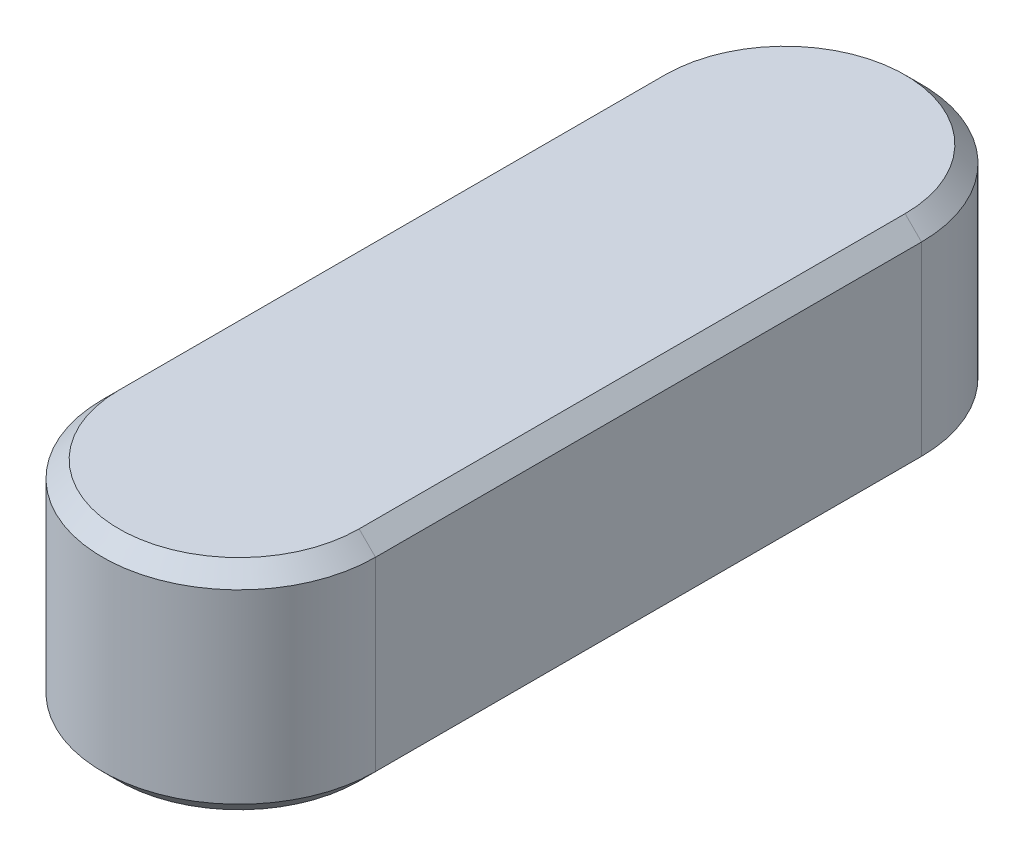
ISO-10303-21;
HEADER;
FILE_DESCRIPTION(('STEP AP214'),'2;1');
FILE_NAME('part.step','',(''),(''),'','','');
FILE_SCHEMA(('AUTOMOTIVE_DESIGN { 1 0 10303 214 1 1 1 1 }'));
ENDSEC;
DATA;
#1=APPLICATION_CONTEXT('core data for automotive mechanical design processes');
#2=APPLICATION_PROTOCOL_DEFINITION('international standard','automotive_design',2000,#1);
#3=PRODUCT_CONTEXT('',#1,'mechanical');
#4=PRODUCT('Part','Part','',(#3));
#5=PRODUCT_RELATED_PRODUCT_CATEGORY('part','',(#4));
#6=PRODUCT_DEFINITION_FORMATION('','',#4);
#7=PRODUCT_DEFINITION_CONTEXT('part definition',#1,'design');
#8=PRODUCT_DEFINITION('design','',#6,#7);
#9=PRODUCT_DEFINITION_SHAPE('','',#8);
#10=(LENGTH_UNIT() NAMED_UNIT(*) SI_UNIT(.MILLI.,.METRE.));
#11=(NAMED_UNIT(*) PLANE_ANGLE_UNIT() SI_UNIT($,.RADIAN.));
#12=(NAMED_UNIT(*) SI_UNIT($,.STERADIAN.) SOLID_ANGLE_UNIT());
#13=UNCERTAINTY_MEASURE_WITH_UNIT(LENGTH_MEASURE(1.E-05),#10,'distance_accuracy_value','');
#14=(GEOMETRIC_REPRESENTATION_CONTEXT(3) GLOBAL_UNCERTAINTY_ASSIGNED_CONTEXT((#13)) GLOBAL_UNIT_ASSIGNED_CONTEXT((#10,
#11,#12)) REPRESENTATION_CONTEXT('',''));
#15=CARTESIAN_POINT('',(0.,0.,0.));
#16=DIRECTION('',(0.,0.,1.));
#17=DIRECTION('',(1.,0.,0.));
#18=AXIS2_PLACEMENT_3D('',#15,#16,#17);
#19=CARTESIAN_POINT('',(0.,8.,0.));
#20=DIRECTION('',(0.,-1.,0.));
#21=DIRECTION('',(0.,0.,-1.));
#22=AXIS2_PLACEMENT_3D('',#19,#20,#21);
#23=CYLINDRICAL_SURFACE('',#22,5.);
#24=DIRECTION('',(0.,-1.,0.));
#25=VECTOR('',#24,1.);
#26=CARTESIAN_POINT('',(5.,8.,0.));
#27=LINE('',#26,#25);
#28=CARTESIAN_POINT('',(5.,7.4,0.));
#29=VERTEX_POINT('',#28);
#30=CARTESIAN_POINT('',(5.,0.6,0.));
#31=VERTEX_POINT('',#30);
#32=EDGE_CURVE('E137',#29,#31,#27,.T.);
#33=ORIENTED_EDGE('',*,*,#32,.F.);
#34=CARTESIAN_POINT('',(0.,7.4,0.));
#35=DIRECTION('',(0.,-1.,0.));
#36=DIRECTION('',(0.,0.,-1.));
#37=AXIS2_PLACEMENT_3D('',#34,#35,#36);
#38=CIRCLE('',#37,5.);
#39=CARTESIAN_POINT('',(-5.,7.4,0.));
#40=VERTEX_POINT('',#39);
#41=EDGE_CURVE('E140',#29,#40,#38,.T.);
#42=ORIENTED_EDGE('',*,*,#41,.T.);
#43=DIRECTION('',(0.,-1.,0.));
#44=VECTOR('',#43,1.);
#45=CARTESIAN_POINT('',(-5.,8.,0.));
#46=LINE('',#45,#44);
#47=CARTESIAN_POINT('',(-5.,0.6,0.));
#48=VERTEX_POINT('',#47);
#49=EDGE_CURVE('E146',#40,#48,#46,.T.);
#50=ORIENTED_EDGE('',*,*,#49,.T.);
#51=CARTESIAN_POINT('',(0.,0.6,0.));
#52=DIRECTION('',(0.,-1.,0.));
#53=DIRECTION('',(0.,0.,-1.));
#54=AXIS2_PLACEMENT_3D('',#51,#52,#53);
#55=CIRCLE('',#54,5.);
#56=EDGE_CURVE('E193',#48,#31,#55,.F.);
#57=ORIENTED_EDGE('',*,*,#56,.T.);
#58=EDGE_LOOP('',(#33,#42,#50,#57));
#59=FACE_BOUND('',#58,.T.);
#60=ADVANCED_FACE('F45',(#59),#23,.T.);
#61=CARTESIAN_POINT('',(5.,8.,0.));
#62=DIRECTION('',(-1.,0.,0.));
#63=DIRECTION('',(0.,0.,1.));
#64=AXIS2_PLACEMENT_3D('',#61,#62,#63);
#65=PLANE('',#64);
#66=DIRECTION('',(0.,-1.,0.));
#67=VECTOR('',#66,1.);
#68=CARTESIAN_POINT('',(5.,8.,-20.));
#69=LINE('',#68,#67);
#70=CARTESIAN_POINT('',(5.,7.4,-20.));
#71=VERTEX_POINT('',#70);
#72=CARTESIAN_POINT('',(5.,0.6,-20.));
#73=VERTEX_POINT('',#72);
#74=EDGE_CURVE('E211',#71,#73,#69,.T.);
#75=ORIENTED_EDGE('',*,*,#74,.F.);
#76=DIRECTION('',(0.,0.,1.));
#77=VECTOR('',#76,1.);
#78=CARTESIAN_POINT('',(5.,7.4,0.));
#79=LINE('',#78,#77);
#80=EDGE_CURVE('E179',#71,#29,#79,.T.);
#81=ORIENTED_EDGE('',*,*,#80,.T.);
#82=ORIENTED_EDGE('',*,*,#32,.T.);
#83=DIRECTION('',(0.,0.,-1.));
#84=VECTOR('',#83,1.);
#85=CARTESIAN_POINT('',(5.,0.6,-20.));
#86=LINE('',#85,#84);
#87=EDGE_CURVE('E182',#31,#73,#86,.T.);
#88=ORIENTED_EDGE('',*,*,#87,.T.);
#89=EDGE_LOOP('',(#75,#81,#82,#88));
#90=FACE_BOUND('',#89,.T.);
#91=ADVANCED_FACE('F236',(#90),#65,.F.);
#92=CARTESIAN_POINT('',(0.,8.,-20.));
#93=DIRECTION('',(0.,-1.,0.));
#94=DIRECTION('',(0.,0.,-1.));
#95=AXIS2_PLACEMENT_3D('',#92,#93,#94);
#96=CYLINDRICAL_SURFACE('',#95,5.);
#97=DIRECTION('',(0.,-1.,0.));
#98=VECTOR('',#97,1.);
#99=CARTESIAN_POINT('',(-5.,8.,-20.));
#100=LINE('',#99,#98);
#101=CARTESIAN_POINT('',(-5.,7.4,-20.));
#102=VERTEX_POINT('',#101);
#103=CARTESIAN_POINT('',(-5.,0.6,-20.));
#104=VERTEX_POINT('',#103);
#105=EDGE_CURVE('E215',#102,#104,#100,.T.);
#106=ORIENTED_EDGE('',*,*,#105,.F.);
#107=CARTESIAN_POINT('',(0.,7.4,-20.));
#108=DIRECTION('',(0.,-1.,0.));
#109=DIRECTION('',(0.,0.,-1.));
#110=AXIS2_PLACEMENT_3D('',#107,#108,#109);
#111=CIRCLE('',#110,5.);
#112=EDGE_CURVE('E185',#102,#71,#111,.T.);
#113=ORIENTED_EDGE('',*,*,#112,.T.);
#114=ORIENTED_EDGE('',*,*,#74,.T.);
#115=CARTESIAN_POINT('',(0.,0.6,-20.));
#116=DIRECTION('',(0.,-1.,0.));
#117=DIRECTION('',(0.,0.,-1.));
#118=AXIS2_PLACEMENT_3D('',#115,#116,#117);
#119=CIRCLE('',#118,5.);
#120=EDGE_CURVE('E188',#73,#104,#119,.F.);
#121=ORIENTED_EDGE('',*,*,#120,.T.);
#122=EDGE_LOOP('',(#106,#113,#114,#121));
#123=FACE_BOUND('',#122,.T.);
#124=ADVANCED_FACE('F234',(#123),#96,.T.);
#125=CARTESIAN_POINT('',(-5.,8.,0.));
#126=DIRECTION('',(1.,0.,0.));
#127=DIRECTION('',(0.,0.,-1.));
#128=AXIS2_PLACEMENT_3D('',#125,#126,#127);
#129=PLANE('',#128);
#130=ORIENTED_EDGE('',*,*,#49,.F.);
#131=DIRECTION('',(0.,0.,-1.));
#132=VECTOR('',#131,1.);
#133=CARTESIAN_POINT('',(-5.,7.4,0.));
#134=LINE('',#133,#132);
#135=EDGE_CURVE('E196',#40,#102,#134,.T.);
#136=ORIENTED_EDGE('',*,*,#135,.T.);
#137=ORIENTED_EDGE('',*,*,#105,.T.);
#138=DIRECTION('',(0.,0.,1.));
#139=VECTOR('',#138,1.);
#140=CARTESIAN_POINT('',(-5.,0.6,0.));
#141=LINE('',#140,#139);
#142=EDGE_CURVE('E200',#104,#48,#141,.T.);
#143=ORIENTED_EDGE('',*,*,#142,.T.);
#144=EDGE_LOOP('',(#130,#136,#137,#143));
#145=FACE_BOUND('',#144,.T.);
#146=ADVANCED_FACE('F225',(#145),#129,.F.);
#147=CARTESIAN_POINT('',(0.,8.,0.));
#148=DIRECTION('',(0.,-1.,0.));
#149=DIRECTION('',(0.,0.,-1.));
#150=AXIS2_PLACEMENT_3D('',#147,#148,#149);
#151=PLANE('',#150);
#152=CARTESIAN_POINT('',(0.,8.,-20.));
#153=DIRECTION('',(0.,-1.,0.));
#154=DIRECTION('',(0.,0.,-1.));
#155=AXIS2_PLACEMENT_3D('',#152,#153,#154);
#156=CIRCLE('',#155,4.4);
#157=CARTESIAN_POINT('',(4.4,8.,-20.));
#158=VERTEX_POINT('',#157);
#159=CARTESIAN_POINT('',(-4.4,8.,-20.));
#160=VERTEX_POINT('',#159);
#161=EDGE_CURVE('E125',#158,#160,#156,.F.);
#162=ORIENTED_EDGE('',*,*,#161,.T.);
#163=DIRECTION('',(0.,0.,1.));
#164=VECTOR('',#163,1.);
#165=CARTESIAN_POINT('',(-4.4,8.,0.));
#166=LINE('',#165,#164);
#167=CARTESIAN_POINT('',(-4.4,8.,0.));
#168=VERTEX_POINT('',#167);
#169=EDGE_CURVE('E120',#160,#168,#166,.T.);
#170=ORIENTED_EDGE('',*,*,#169,.T.);
#171=CARTESIAN_POINT('',(0.,8.,0.));
#172=DIRECTION('',(0.,-1.,0.));
#173=DIRECTION('',(0.,0.,-1.));
#174=AXIS2_PLACEMENT_3D('',#171,#172,#173);
#175=CIRCLE('',#174,4.4);
#176=CARTESIAN_POINT('',(4.4,8.,0.));
#177=VERTEX_POINT('',#176);
#178=EDGE_CURVE('E114',#168,#177,#175,.F.);
#179=ORIENTED_EDGE('',*,*,#178,.T.);
#180=DIRECTION('',(0.,0.,-1.));
#181=VECTOR('',#180,1.);
#182=CARTESIAN_POINT('',(4.4,8.,0.));
#183=LINE('',#182,#181);
#184=EDGE_CURVE('E117',#177,#158,#183,.T.);
#185=ORIENTED_EDGE('',*,*,#184,.T.);
#186=EDGE_LOOP('',(#162,#170,#179,#185));
#187=FACE_BOUND('',#186,.T.);
#188=ADVANCED_FACE('F116',(#187),#151,.F.);
#189=CARTESIAN_POINT('',(0.,0.,0.));
#190=DIRECTION('',(0.,-1.,0.));
#191=DIRECTION('',(0.,0.,-1.));
#192=AXIS2_PLACEMENT_3D('',#189,#190,#191);
#193=PLANE('',#192);
#194=CARTESIAN_POINT('',(0.,0.,0.));
#195=DIRECTION('',(0.,-1.,0.));
#196=DIRECTION('',(0.,0.,-1.));
#197=AXIS2_PLACEMENT_3D('',#194,#195,#196);
#198=CIRCLE('',#197,4.4);
#199=CARTESIAN_POINT('',(4.4,0.,0.));
#200=VERTEX_POINT('',#199);
#201=CARTESIAN_POINT('',(-4.4,0.,0.));
#202=VERTEX_POINT('',#201);
#203=EDGE_CURVE('E56',#200,#202,#198,.T.);
#204=ORIENTED_EDGE('',*,*,#203,.T.);
#205=DIRECTION('',(0.,0.,-1.));
#206=VECTOR('',#205,1.);
#207=CARTESIAN_POINT('',(-4.4,0.,-20.));
#208=LINE('',#207,#206);
#209=CARTESIAN_POINT('',(-4.4,0.,-20.));
#210=VERTEX_POINT('',#209);
#211=EDGE_CURVE('E11',#202,#210,#208,.T.);
#212=ORIENTED_EDGE('',*,*,#211,.T.);
#213=CARTESIAN_POINT('',(0.,0.,-20.));
#214=DIRECTION('',(0.,-1.,0.));
#215=DIRECTION('',(0.,0.,-1.));
#216=AXIS2_PLACEMENT_3D('',#213,#214,#215);
#217=CIRCLE('',#216,4.4);
#218=CARTESIAN_POINT('',(4.4,0.,-20.));
#219=VERTEX_POINT('',#218);
#220=EDGE_CURVE('E173',#210,#219,#217,.T.);
#221=ORIENTED_EDGE('',*,*,#220,.T.);
#222=DIRECTION('',(0.,0.,1.));
#223=VECTOR('',#222,1.);
#224=CARTESIAN_POINT('',(4.4,0.,0.));
#225=LINE('',#224,#223);
#226=EDGE_CURVE('E176',#219,#200,#225,.T.);
#227=ORIENTED_EDGE('',*,*,#226,.T.);
#228=EDGE_LOOP('',(#204,#212,#221,#227));
#229=FACE_BOUND('',#228,.T.);
#230=ADVANCED_FACE('F279',(#229),#193,.T.);
#231=CARTESIAN_POINT('',(4.4,8.,0.));
#232=DIRECTION('',(-0.707106781186547,-0.707106781186547,0.));
#233=DIRECTION('',(0.,0.,-1.));
#234=AXIS2_PLACEMENT_3D('',#231,#232,#233);
#235=PLANE('',#234);
#236=DIRECTION('',(-0.707106781186547,0.707106781186547,0.));
#237=VECTOR('',#236,1.);
#238=CARTESIAN_POINT('',(5.,7.4,0.));
#239=LINE('',#238,#237);
#240=EDGE_CURVE('E131',#29,#177,#239,.T.);
#241=ORIENTED_EDGE('',*,*,#240,.F.);
#242=ORIENTED_EDGE('',*,*,#80,.F.);
#243=DIRECTION('',(0.707106781186547,-0.707106781186547,0.));
#244=VECTOR('',#243,1.);
#245=CARTESIAN_POINT('',(4.4,8.,-20.));
#246=LINE('',#245,#244);
#247=EDGE_CURVE('E134',#158,#71,#246,.T.);
#248=ORIENTED_EDGE('',*,*,#247,.F.);
#249=ORIENTED_EDGE('',*,*,#184,.F.);
#250=EDGE_LOOP('',(#241,#242,#248,#249));
#251=FACE_BOUND('',#250,.T.);
#252=ADVANCED_FACE('F129',(#251),#235,.F.);
#253=CARTESIAN_POINT('',(0.,8.,-20.));
#254=DIRECTION('',(0.,-1.,0.));
#255=DIRECTION('',(0.,0.,-1.));
#256=AXIS2_PLACEMENT_3D('',#253,#254,#255);
#257=CONICAL_SURFACE('',#256,4.4,0.785398163397448);
#258=ORIENTED_EDGE('',*,*,#247,.T.);
#259=ORIENTED_EDGE('',*,*,#112,.F.);
#260=DIRECTION('',(-0.707106781186547,-0.707106781186547,0.));
#261=VECTOR('',#260,1.);
#262=CARTESIAN_POINT('',(-4.4,8.,-20.));
#263=LINE('',#262,#261);
#264=EDGE_CURVE('E142',#160,#102,#263,.T.);
#265=ORIENTED_EDGE('',*,*,#264,.F.);
#266=ORIENTED_EDGE('',*,*,#161,.F.);
#267=EDGE_LOOP('',(#258,#259,#265,#266));
#268=FACE_BOUND('',#267,.T.);
#269=ADVANCED_FACE('F231',(#268),#257,.T.);
#270=CARTESIAN_POINT('',(0.,8.,0.));
#271=DIRECTION('',(0.,-1.,0.));
#272=DIRECTION('',(0.,0.,-1.));
#273=AXIS2_PLACEMENT_3D('',#270,#271,#272);
#274=CONICAL_SURFACE('',#273,4.4,0.785398163397448);
#275=ORIENTED_EDGE('',*,*,#240,.T.);
#276=ORIENTED_EDGE('',*,*,#178,.F.);
#277=DIRECTION('',(0.707106781186547,0.707106781186547,0.));
#278=VECTOR('',#277,1.);
#279=CARTESIAN_POINT('',(-5.,7.4,0.));
#280=LINE('',#279,#278);
#281=EDGE_CURVE('E148',#40,#168,#280,.T.);
#282=ORIENTED_EDGE('',*,*,#281,.F.);
#283=ORIENTED_EDGE('',*,*,#41,.F.);
#284=EDGE_LOOP('',(#275,#276,#282,#283));
#285=FACE_BOUND('',#284,.T.);
#286=ADVANCED_FACE('F139',(#285),#274,.T.);
#287=CARTESIAN_POINT('',(-4.4,8.,0.));
#288=DIRECTION('',(0.707106781186547,-0.707106781186547,0.));
#289=DIRECTION('',(0.,0.,1.));
#290=AXIS2_PLACEMENT_3D('',#287,#288,#289);
#291=PLANE('',#290);
#292=ORIENTED_EDGE('',*,*,#264,.T.);
#293=ORIENTED_EDGE('',*,*,#135,.F.);
#294=ORIENTED_EDGE('',*,*,#281,.T.);
#295=ORIENTED_EDGE('',*,*,#169,.F.);
#296=EDGE_LOOP('',(#292,#293,#294,#295));
#297=FACE_BOUND('',#296,.T.);
#298=ADVANCED_FACE('F227',(#297),#291,.F.);
#299=CARTESIAN_POINT('',(5.,0.6,0.));
#300=DIRECTION('',(0.707106781186547,-0.707106781186547,0.));
#301=DIRECTION('',(0.,0.,1.));
#302=AXIS2_PLACEMENT_3D('',#299,#300,#301);
#303=PLANE('',#302);
#304=DIRECTION('',(0.707106781186547,0.707106781186547,0.));
#305=VECTOR('',#304,1.);
#306=CARTESIAN_POINT('',(4.4,0.,0.));
#307=LINE('',#306,#305);
#308=EDGE_CURVE('E156',#200,#31,#307,.T.);
#309=ORIENTED_EDGE('',*,*,#308,.F.);
#310=ORIENTED_EDGE('',*,*,#226,.F.);
#311=DIRECTION('',(-0.707106781186547,-0.707106781186547,0.));
#312=VECTOR('',#311,1.);
#313=CARTESIAN_POINT('',(5.,0.6,-20.));
#314=LINE('',#313,#312);
#315=EDGE_CURVE('E50',#73,#219,#314,.T.);
#316=ORIENTED_EDGE('',*,*,#315,.F.);
#317=ORIENTED_EDGE('',*,*,#87,.F.);
#318=EDGE_LOOP('',(#309,#310,#316,#317));
#319=FACE_BOUND('',#318,.T.);
#320=ADVANCED_FACE('F48',(#319),#303,.T.);
#321=CARTESIAN_POINT('',(0.,0.6,-20.));
#322=DIRECTION('',(0.,1.,0.));
#323=DIRECTION('',(0.,0.,1.));
#324=AXIS2_PLACEMENT_3D('',#321,#322,#323);
#325=CONICAL_SURFACE('',#324,5.,0.785398163397448);
#326=ORIENTED_EDGE('',*,*,#315,.T.);
#327=ORIENTED_EDGE('',*,*,#220,.F.);
#328=DIRECTION('',(0.707106781186547,-0.707106781186547,0.));
#329=VECTOR('',#328,1.);
#330=CARTESIAN_POINT('',(-5.,0.6,-20.));
#331=LINE('',#330,#329);
#332=EDGE_CURVE('E69',#104,#210,#331,.T.);
#333=ORIENTED_EDGE('',*,*,#332,.F.);
#334=ORIENTED_EDGE('',*,*,#120,.F.);
#335=EDGE_LOOP('',(#326,#327,#333,#334));
#336=FACE_BOUND('',#335,.T.);
#337=ADVANCED_FACE('F240',(#336),#325,.T.);
#338=CARTESIAN_POINT('',(0.,0.6,0.));
#339=DIRECTION('',(0.,1.,0.));
#340=DIRECTION('',(0.,0.,1.));
#341=AXIS2_PLACEMENT_3D('',#338,#339,#340);
#342=CONICAL_SURFACE('',#341,5.,0.785398163397448);
#343=ORIENTED_EDGE('',*,*,#308,.T.);
#344=ORIENTED_EDGE('',*,*,#56,.F.);
#345=DIRECTION('',(-0.707106781186547,0.707106781186547,0.));
#346=VECTOR('',#345,1.);
#347=CARTESIAN_POINT('',(-4.4,0.,0.));
#348=LINE('',#347,#346);
#349=EDGE_CURVE('E152',#202,#48,#348,.T.);
#350=ORIENTED_EDGE('',*,*,#349,.F.);
#351=ORIENTED_EDGE('',*,*,#203,.F.);
#352=EDGE_LOOP('',(#343,#344,#350,#351));
#353=FACE_BOUND('',#352,.T.);
#354=ADVANCED_FACE('F243',(#353),#342,.T.);
#355=CARTESIAN_POINT('',(-5.,0.6,0.));
#356=DIRECTION('',(-0.707106781186547,-0.707106781186547,0.));
#357=DIRECTION('',(0.,0.,-1.));
#358=AXIS2_PLACEMENT_3D('',#355,#356,#357);
#359=PLANE('',#358);
#360=ORIENTED_EDGE('',*,*,#332,.T.);
#361=ORIENTED_EDGE('',*,*,#211,.F.);
#362=ORIENTED_EDGE('',*,*,#349,.T.);
#363=ORIENTED_EDGE('',*,*,#142,.F.);
#364=EDGE_LOOP('',(#360,#361,#362,#363));
#365=FACE_BOUND('',#364,.T.);
#366=ADVANCED_FACE('F241',(#365),#359,.T.);
#367=CLOSED_SHELL('',(#60,#91,#124,#146,#188,#230,#252,#269,#286,#298,#320,#337,#354,#366));
#368=MANIFOLD_SOLID_BREP('B2',#367);
#369=ADVANCED_BREP_SHAPE_REPRESENTATION('',(#18,#368),#14);
#370=SHAPE_DEFINITION_REPRESENTATION(#9,#369);
ENDSEC;
END-ISO-10303-21;
